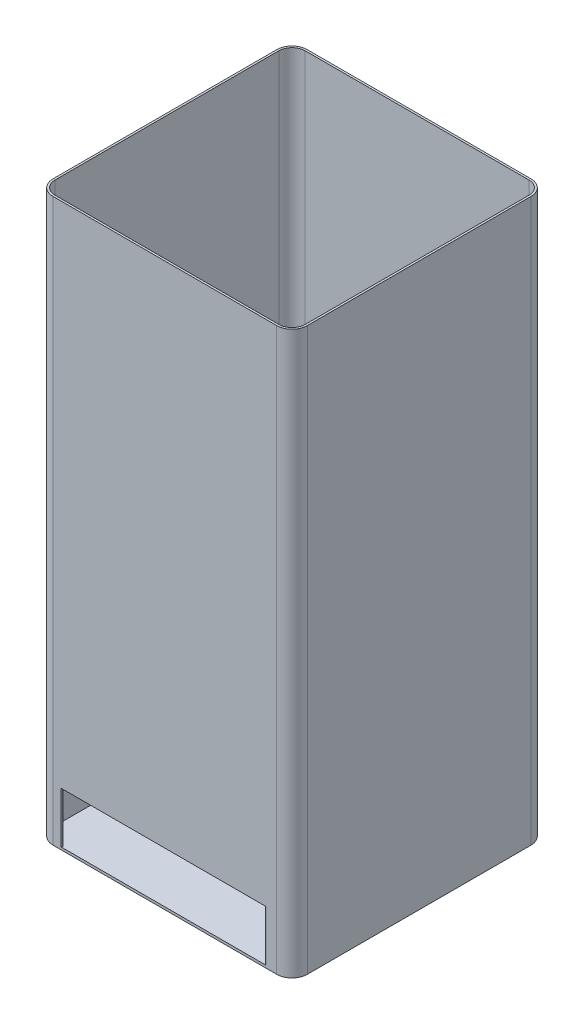
ISO-10303-21;
HEADER;
FILE_DESCRIPTION(('STEP AP214'),'2;1');
FILE_NAME('part.step','',(''),(''),'','','');
FILE_SCHEMA(('AUTOMOTIVE_DESIGN { 1 0 10303 214 1 1 1 1 }'));
ENDSEC;
DATA;
#1=APPLICATION_CONTEXT('core data for automotive mechanical design processes');
#2=APPLICATION_PROTOCOL_DEFINITION('international standard','automotive_design',2000,#1);
#3=PRODUCT_CONTEXT('',#1,'mechanical');
#4=PRODUCT('Part','Part','',(#3));
#5=PRODUCT_RELATED_PRODUCT_CATEGORY('part','',(#4));
#6=PRODUCT_DEFINITION_FORMATION('','',#4);
#7=PRODUCT_DEFINITION_CONTEXT('part definition',#1,'design');
#8=PRODUCT_DEFINITION('design','',#6,#7);
#9=PRODUCT_DEFINITION_SHAPE('','',#8);
#10=(LENGTH_UNIT() NAMED_UNIT(*) SI_UNIT(.MILLI.,.METRE.));
#11=(NAMED_UNIT(*) PLANE_ANGLE_UNIT() SI_UNIT($,.RADIAN.));
#12=(NAMED_UNIT(*) SI_UNIT($,.STERADIAN.) SOLID_ANGLE_UNIT());
#13=UNCERTAINTY_MEASURE_WITH_UNIT(LENGTH_MEASURE(1.E-05),#10,'distance_accuracy_value','');
#14=(GEOMETRIC_REPRESENTATION_CONTEXT(3) GLOBAL_UNCERTAINTY_ASSIGNED_CONTEXT((#13)) GLOBAL_UNIT_ASSIGNED_CONTEXT((#10,
#11,#12)) REPRESENTATION_CONTEXT('',''));
#15=CARTESIAN_POINT('',(0.,0.,0.));
#16=DIRECTION('',(0.,0.,1.));
#17=DIRECTION('',(1.,0.,0.));
#18=AXIS2_PLACEMENT_3D('',#15,#16,#17);
#19=CARTESIAN_POINT('',(220.,5.,220.));
#20=DIRECTION('',(0.,-1.,0.));
#21=DIRECTION('',(0.,0.,-1.));
#22=AXIS2_PLACEMENT_3D('',#19,#20,#21);
#23=PLANE('',#22);
#24=CARTESIAN_POINT('',(-204.515980857848,5.,248.5));
#25=DIRECTION('',(0.,1.,0.));
#26=DIRECTION('',(0.,0.,1.));
#27=AXIS2_PLACEMENT_3D('',#24,#25,#26);
#28=CIRCLE('',#27,1.5);
#29=CARTESIAN_POINT('',(-204.515980857848,5.,250.));
#30=VERTEX_POINT('',#29);
#31=CARTESIAN_POINT('',(-203.015980857848,5.,248.5));
#32=VERTEX_POINT('',#31);
#33=EDGE_CURVE('E364',#30,#32,#28,.T.);
#34=ORIENTED_EDGE('',*,*,#33,.F.);
#35=DIRECTION('',(1.,0.,0.));
#36=VECTOR('',#35,1.);
#37=CARTESIAN_POINT('',(220.,5.,250.));
#38=LINE('',#37,#36);
#39=CARTESIAN_POINT('',(198.484019142152,5.,250.));
#40=VERTEX_POINT('',#39);
#41=EDGE_CURVE('E438',#30,#40,#38,.T.);
#42=ORIENTED_EDGE('',*,*,#41,.T.);
#43=CARTESIAN_POINT('',(198.484019142152,5.,248.5));
#44=DIRECTION('',(0.,1.,0.));
#45=DIRECTION('',(0.,0.,-1.));
#46=AXIS2_PLACEMENT_3D('',#43,#44,#45);
#47=CIRCLE('',#46,1.5);
#48=CARTESIAN_POINT('',(196.984019142152,5.,248.5));
#49=VERTEX_POINT('',#48);
#50=EDGE_CURVE('E360',#49,#40,#47,.T.);
#51=ORIENTED_EDGE('',*,*,#50,.F.);
#52=DIRECTION('',(0.,0.,1.));
#53=VECTOR('',#52,1.);
#54=CARTESIAN_POINT('',(196.984019142152,5.,248.5));
#55=LINE('',#54,#53);
#56=CARTESIAN_POINT('',(196.984019142152,5.,247.5));
#57=VERTEX_POINT('',#56);
#58=EDGE_CURVE('E356',#57,#49,#55,.T.);
#59=ORIENTED_EDGE('',*,*,#58,.F.);
#60=CARTESIAN_POINT('',(198.484019142152,5.,247.5));
#61=DIRECTION('',(0.,1.,0.));
#62=DIRECTION('',(0.,0.,-1.));
#63=AXIS2_PLACEMENT_3D('',#60,#61,#62);
#64=CIRCLE('',#63,1.5);
#65=CARTESIAN_POINT('',(198.484019142152,5.,246.));
#66=VERTEX_POINT('',#65);
#67=EDGE_CURVE('E352',#66,#57,#64,.T.);
#68=ORIENTED_EDGE('',*,*,#67,.F.);
#69=DIRECTION('',(-1.,0.,0.));
#70=VECTOR('',#69,1.);
#71=CARTESIAN_POINT('',(198.484019142152,5.,246.));
#72=LINE('',#71,#70);
#73=CARTESIAN_POINT('',(220.,5.,246.));
#74=VERTEX_POINT('',#73);
#75=EDGE_CURVE('E348',#74,#66,#72,.T.);
#76=ORIENTED_EDGE('',*,*,#75,.F.);
#77=CARTESIAN_POINT('',(220.,5.,220.));
#78=DIRECTION('',(0.,-1.,0.));
#79=DIRECTION('',(0.,0.,-1.));
#80=AXIS2_PLACEMENT_3D('',#77,#78,#79);
#81=CIRCLE('',#80,25.9999999999999);
#82=CARTESIAN_POINT('',(246.,5.,220.));
#83=VERTEX_POINT('',#82);
#84=EDGE_CURVE('E344',#83,#74,#81,.T.);
#85=ORIENTED_EDGE('',*,*,#84,.F.);
#86=DIRECTION('',(0.,0.,1.));
#87=VECTOR('',#86,1.);
#88=CARTESIAN_POINT('',(246.,5.,-220.));
#89=LINE('',#88,#87);
#90=CARTESIAN_POINT('',(246.,5.,-220.));
#91=VERTEX_POINT('',#90);
#92=EDGE_CURVE('E340',#91,#83,#89,.T.);
#93=ORIENTED_EDGE('',*,*,#92,.F.);
#94=CARTESIAN_POINT('',(220.,5.,-220.));
#95=DIRECTION('',(0.,-1.,0.));
#96=DIRECTION('',(0.,0.,-1.));
#97=AXIS2_PLACEMENT_3D('',#94,#95,#96);
#98=CIRCLE('',#97,25.9999999999998);
#99=CARTESIAN_POINT('',(220.,5.,-246.));
#100=VERTEX_POINT('',#99);
#101=EDGE_CURVE('E336',#100,#91,#98,.T.);
#102=ORIENTED_EDGE('',*,*,#101,.F.);
#103=DIRECTION('',(1.,0.,0.));
#104=VECTOR('',#103,1.);
#105=CARTESIAN_POINT('',(-220.,5.,-246.));
#106=LINE('',#105,#104);
#107=CARTESIAN_POINT('',(-220.,5.,-246.));
#108=VERTEX_POINT('',#107);
#109=EDGE_CURVE('E332',#108,#100,#106,.T.);
#110=ORIENTED_EDGE('',*,*,#109,.F.);
#111=CARTESIAN_POINT('',(-220.,5.,-220.));
#112=DIRECTION('',(0.,-1.,0.));
#113=DIRECTION('',(0.,0.,1.));
#114=AXIS2_PLACEMENT_3D('',#111,#112,#113);
#115=CIRCLE('',#114,25.9999999999999);
#116=CARTESIAN_POINT('',(-246.,5.,-220.));
#117=VERTEX_POINT('',#116);
#118=EDGE_CURVE('E328',#117,#108,#115,.T.);
#119=ORIENTED_EDGE('',*,*,#118,.F.);
#120=DIRECTION('',(0.,0.,-1.));
#121=VECTOR('',#120,1.);
#122=CARTESIAN_POINT('',(-246.,5.,-220.));
#123=LINE('',#122,#121);
#124=CARTESIAN_POINT('',(-246.,5.,220.));
#125=VERTEX_POINT('',#124);
#126=EDGE_CURVE('E324',#125,#117,#123,.T.);
#127=ORIENTED_EDGE('',*,*,#126,.F.);
#128=CARTESIAN_POINT('',(-220.,5.,220.));
#129=DIRECTION('',(0.,-1.,0.));
#130=DIRECTION('',(0.,0.,1.));
#131=AXIS2_PLACEMENT_3D('',#128,#129,#130);
#132=CIRCLE('',#131,26.);
#133=CARTESIAN_POINT('',(-220.,5.,246.));
#134=VERTEX_POINT('',#133);
#135=EDGE_CURVE('E291',#134,#125,#132,.T.);
#136=ORIENTED_EDGE('',*,*,#135,.F.);
#137=DIRECTION('',(-1.,0.,0.));
#138=VECTOR('',#137,1.);
#139=CARTESIAN_POINT('',(-220.,5.,246.));
#140=LINE('',#139,#138);
#141=CARTESIAN_POINT('',(-204.515980857848,5.,246.));
#142=VERTEX_POINT('',#141);
#143=EDGE_CURVE('E300',#142,#134,#140,.T.);
#144=ORIENTED_EDGE('',*,*,#143,.F.);
#145=CARTESIAN_POINT('',(-204.515980857848,5.,247.5));
#146=DIRECTION('',(0.,1.,0.));
#147=DIRECTION('',(0.,0.,1.));
#148=AXIS2_PLACEMENT_3D('',#145,#146,#147);
#149=CIRCLE('',#148,1.5);
#150=CARTESIAN_POINT('',(-203.015980857848,5.,247.5));
#151=VERTEX_POINT('',#150);
#152=EDGE_CURVE('E62',#151,#142,#149,.T.);
#153=ORIENTED_EDGE('',*,*,#152,.F.);
#154=DIRECTION('',(0.,0.,-1.));
#155=VECTOR('',#154,1.);
#156=CARTESIAN_POINT('',(-203.015980857848,5.,248.5));
#157=LINE('',#156,#155);
#158=EDGE_CURVE('E57',#32,#151,#157,.T.);
#159=ORIENTED_EDGE('',*,*,#158,.F.);
#160=EDGE_LOOP('',(#34,#42,#51,#59,#68,#76,#85,#93,#102,#110,#119,#127,#136,#144,#153,#159));
#161=FACE_BOUND('',#160,.T.);
#162=ADVANCED_FACE('F41',(#161),#23,.F.);
#163=CARTESIAN_POINT('',(220.,5.,220.));
#164=DIRECTION('',(0.,-1.,0.));
#165=DIRECTION('',(0.,0.,-1.));
#166=AXIS2_PLACEMENT_3D('',#163,#164,#165);
#167=CYLINDRICAL_SURFACE('',#166,29.9999999999999);
#168=CARTESIAN_POINT('',(220.,0.,220.));
#169=DIRECTION('',(0.,1.,0.));
#170=DIRECTION('',(0.,0.,-1.));
#171=AXIS2_PLACEMENT_3D('',#168,#169,#170);
#172=CIRCLE('',#171,29.9999999999999);
#173=CARTESIAN_POINT('',(220.,0.,250.));
#174=VERTEX_POINT('',#173);
#175=CARTESIAN_POINT('',(250.,0.,220.));
#176=VERTEX_POINT('',#175);
#177=EDGE_CURVE('E437',#174,#176,#172,.T.);
#178=ORIENTED_EDGE('',*,*,#177,.T.);
#179=DIRECTION('',(0.,-1.,0.));
#180=VECTOR('',#179,1.);
#181=CARTESIAN_POINT('',(250.,5.,220.));
#182=LINE('',#181,#180);
#183=CARTESIAN_POINT('',(250.,1105.,220.));
#184=VERTEX_POINT('',#183);
#185=EDGE_CURVE('E11',#184,#176,#182,.T.);
#186=ORIENTED_EDGE('',*,*,#185,.F.);
#187=CARTESIAN_POINT('',(220.,1105.,220.));
#188=DIRECTION('',(0.,1.,0.));
#189=DIRECTION('',(0.,0.,1.));
#190=AXIS2_PLACEMENT_3D('',#187,#188,#189);
#191=CIRCLE('',#190,29.9999999999999);
#192=CARTESIAN_POINT('',(220.,1105.,250.));
#193=VERTEX_POINT('',#192);
#194=EDGE_CURVE('E224',#193,#184,#191,.T.);
#195=ORIENTED_EDGE('',*,*,#194,.F.);
#196=DIRECTION('',(0.,-1.,0.));
#197=VECTOR('',#196,1.);
#198=CARTESIAN_POINT('',(220.,5.,250.));
#199=LINE('',#198,#197);
#200=EDGE_CURVE('E213',#193,#174,#199,.T.);
#201=ORIENTED_EDGE('',*,*,#200,.T.);
#202=EDGE_LOOP('',(#178,#186,#195,#201));
#203=FACE_BOUND('',#202,.T.);
#204=ADVANCED_FACE('F43',(#203),#167,.T.);
#205=CARTESIAN_POINT('',(250.,5.,-220.));
#206=DIRECTION('',(-1.,0.,0.));
#207=DIRECTION('',(0.,0.,1.));
#208=AXIS2_PLACEMENT_3D('',#205,#206,#207);
#209=PLANE('',#208);
#210=DIRECTION('',(0.,0.,-1.));
#211=VECTOR('',#210,1.);
#212=CARTESIAN_POINT('',(250.,0.,-220.));
#213=LINE('',#212,#211);
#214=CARTESIAN_POINT('',(250.,0.,-220.));
#215=VERTEX_POINT('',#214);
#216=EDGE_CURVE('E445',#176,#215,#213,.T.);
#217=ORIENTED_EDGE('',*,*,#216,.T.);
#218=DIRECTION('',(0.,-1.,0.));
#219=VECTOR('',#218,1.);
#220=CARTESIAN_POINT('',(250.,5.,-220.));
#221=LINE('',#220,#219);
#222=CARTESIAN_POINT('',(250.,1105.,-220.));
#223=VERTEX_POINT('',#222);
#224=EDGE_CURVE('E50',#223,#215,#221,.T.);
#225=ORIENTED_EDGE('',*,*,#224,.F.);
#226=DIRECTION('',(0.,0.,-1.));
#227=VECTOR('',#226,1.);
#228=CARTESIAN_POINT('',(250.,1105.,0.));
#229=LINE('',#228,#227);
#230=EDGE_CURVE('E242',#184,#223,#229,.T.);
#231=ORIENTED_EDGE('',*,*,#230,.F.);
#232=ORIENTED_EDGE('',*,*,#185,.T.);
#233=EDGE_LOOP('',(#217,#225,#231,#232));
#234=FACE_BOUND('',#233,.T.);
#235=ADVANCED_FACE('F502',(#234),#209,.F.);
#236=CARTESIAN_POINT('',(220.,5.,-220.));
#237=DIRECTION('',(0.,-1.,0.));
#238=DIRECTION('',(0.,0.,-1.));
#239=AXIS2_PLACEMENT_3D('',#236,#237,#238);
#240=CYLINDRICAL_SURFACE('',#239,29.9999999999999);
#241=CARTESIAN_POINT('',(220.,0.,-220.));
#242=DIRECTION('',(0.,1.,0.));
#243=DIRECTION('',(0.,0.,-1.));
#244=AXIS2_PLACEMENT_3D('',#241,#242,#243);
#245=CIRCLE('',#244,29.9999999999999);
#246=CARTESIAN_POINT('',(220.,0.,-250.));
#247=VERTEX_POINT('',#246);
#248=EDGE_CURVE('E448',#215,#247,#245,.T.);
#249=ORIENTED_EDGE('',*,*,#248,.T.);
#250=DIRECTION('',(0.,-1.,0.));
#251=VECTOR('',#250,1.);
#252=CARTESIAN_POINT('',(220.,5.,-250.));
#253=LINE('',#252,#251);
#254=CARTESIAN_POINT('',(220.,1105.,-250.));
#255=VERTEX_POINT('',#254);
#256=EDGE_CURVE('E476',#255,#247,#253,.T.);
#257=ORIENTED_EDGE('',*,*,#256,.F.);
#258=CARTESIAN_POINT('',(220.,1105.,-220.));
#259=DIRECTION('',(0.,1.,0.));
#260=DIRECTION('',(0.,0.,1.));
#261=AXIS2_PLACEMENT_3D('',#258,#259,#260);
#262=CIRCLE('',#261,29.9999999999998);
#263=EDGE_CURVE('E246',#223,#255,#262,.T.);
#264=ORIENTED_EDGE('',*,*,#263,.F.);
#265=ORIENTED_EDGE('',*,*,#224,.T.);
#266=EDGE_LOOP('',(#249,#257,#264,#265));
#267=FACE_BOUND('',#266,.T.);
#268=ADVANCED_FACE('F484',(#267),#240,.T.);
#269=CARTESIAN_POINT('',(220.,5.,-250.));
#270=DIRECTION('',(0.,0.,1.));
#271=DIRECTION('',(1.,0.,0.));
#272=AXIS2_PLACEMENT_3D('',#269,#270,#271);
#273=PLANE('',#272);
#274=DIRECTION('',(-1.,0.,0.));
#275=VECTOR('',#274,1.);
#276=CARTESIAN_POINT('',(220.,0.,-250.));
#277=LINE('',#276,#275);
#278=CARTESIAN_POINT('',(-220.,0.,-250.));
#279=VERTEX_POINT('',#278);
#280=EDGE_CURVE('E451',#247,#279,#277,.T.);
#281=ORIENTED_EDGE('',*,*,#280,.T.);
#282=DIRECTION('',(0.,-1.,0.));
#283=VECTOR('',#282,1.);
#284=CARTESIAN_POINT('',(-220.,5.,-250.));
#285=LINE('',#284,#283);
#286=CARTESIAN_POINT('',(-220.,1105.,-250.));
#287=VERTEX_POINT('',#286);
#288=EDGE_CURVE('E472',#287,#279,#285,.T.);
#289=ORIENTED_EDGE('',*,*,#288,.F.);
#290=DIRECTION('',(-1.,0.,0.));
#291=VECTOR('',#290,1.);
#292=CARTESIAN_POINT('',(0.,1105.,-250.));
#293=LINE('',#292,#291);
#294=EDGE_CURVE('E250',#255,#287,#293,.T.);
#295=ORIENTED_EDGE('',*,*,#294,.F.);
#296=ORIENTED_EDGE('',*,*,#256,.T.);
#297=EDGE_LOOP('',(#281,#289,#295,#296));
#298=FACE_BOUND('',#297,.T.);
#299=ADVANCED_FACE('F494',(#298),#273,.F.);
#300=CARTESIAN_POINT('',(-220.,5.,-220.));
#301=DIRECTION('',(0.,-1.,0.));
#302=DIRECTION('',(0.,0.,-1.));
#303=AXIS2_PLACEMENT_3D('',#300,#301,#302);
#304=CYLINDRICAL_SURFACE('',#303,29.9999999999999);
#305=CARTESIAN_POINT('',(-220.,0.,-220.));
#306=DIRECTION('',(0.,1.,0.));
#307=DIRECTION('',(0.,0.,1.));
#308=AXIS2_PLACEMENT_3D('',#305,#306,#307);
#309=CIRCLE('',#308,29.9999999999999);
#310=CARTESIAN_POINT('',(-250.,0.,-220.));
#311=VERTEX_POINT('',#310);
#312=EDGE_CURVE('E454',#279,#311,#309,.T.);
#313=ORIENTED_EDGE('',*,*,#312,.T.);
#314=DIRECTION('',(0.,-1.,0.));
#315=VECTOR('',#314,1.);
#316=CARTESIAN_POINT('',(-250.,5.,-220.));
#317=LINE('',#316,#315);
#318=CARTESIAN_POINT('',(-250.,1105.,-220.));
#319=VERTEX_POINT('',#318);
#320=EDGE_CURVE('E468',#319,#311,#317,.T.);
#321=ORIENTED_EDGE('',*,*,#320,.F.);
#322=CARTESIAN_POINT('',(-220.,1105.,-220.));
#323=DIRECTION('',(0.,1.,0.));
#324=DIRECTION('',(0.,0.,1.));
#325=AXIS2_PLACEMENT_3D('',#322,#323,#324);
#326=CIRCLE('',#325,29.9999999999999);
#327=EDGE_CURVE('E254',#287,#319,#326,.T.);
#328=ORIENTED_EDGE('',*,*,#327,.F.);
#329=ORIENTED_EDGE('',*,*,#288,.T.);
#330=EDGE_LOOP('',(#313,#321,#328,#329));
#331=FACE_BOUND('',#330,.T.);
#332=ADVANCED_FACE('F498',(#331),#304,.T.);
#333=CARTESIAN_POINT('',(-250.,5.,-220.));
#334=DIRECTION('',(1.,0.,0.));
#335=DIRECTION('',(0.,0.,-1.));
#336=AXIS2_PLACEMENT_3D('',#333,#334,#335);
#337=PLANE('',#336);
#338=DIRECTION('',(0.,0.,1.));
#339=VECTOR('',#338,1.);
#340=CARTESIAN_POINT('',(-250.,0.,-220.));
#341=LINE('',#340,#339);
#342=CARTESIAN_POINT('',(-250.,0.,220.));
#343=VERTEX_POINT('',#342);
#344=EDGE_CURVE('E457',#311,#343,#341,.T.);
#345=ORIENTED_EDGE('',*,*,#344,.T.);
#346=DIRECTION('',(0.,-1.,0.));
#347=VECTOR('',#346,1.);
#348=CARTESIAN_POINT('',(-250.,5.,220.));
#349=LINE('',#348,#347);
#350=CARTESIAN_POINT('',(-250.,1105.,220.));
#351=VERTEX_POINT('',#350);
#352=EDGE_CURVE('E212',#351,#343,#349,.T.);
#353=ORIENTED_EDGE('',*,*,#352,.F.);
#354=DIRECTION('',(0.,0.,1.));
#355=VECTOR('',#354,1.);
#356=CARTESIAN_POINT('',(-250.,1105.,0.));
#357=LINE('',#356,#355);
#358=EDGE_CURVE('E231',#319,#351,#357,.T.);
#359=ORIENTED_EDGE('',*,*,#358,.F.);
#360=ORIENTED_EDGE('',*,*,#320,.T.);
#361=EDGE_LOOP('',(#345,#353,#359,#360));
#362=FACE_BOUND('',#361,.T.);
#363=ADVANCED_FACE('F500',(#362),#337,.F.);
#364=CARTESIAN_POINT('',(-220.,5.,220.));
#365=DIRECTION('',(0.,-1.,0.));
#366=DIRECTION('',(0.,0.,-1.));
#367=AXIS2_PLACEMENT_3D('',#364,#365,#366);
#368=CYLINDRICAL_SURFACE('',#367,29.9999999999999);
#369=CARTESIAN_POINT('',(-220.,0.,220.));
#370=DIRECTION('',(0.,1.,0.));
#371=DIRECTION('',(0.,0.,-1.));
#372=AXIS2_PLACEMENT_3D('',#369,#370,#371);
#373=CIRCLE('',#372,29.9999999999999);
#374=CARTESIAN_POINT('',(-220.,0.,250.));
#375=VERTEX_POINT('',#374);
#376=EDGE_CURVE('E208',#343,#375,#373,.T.);
#377=ORIENTED_EDGE('',*,*,#376,.T.);
#378=DIRECTION('',(0.,-1.,0.));
#379=VECTOR('',#378,1.);
#380=CARTESIAN_POINT('',(-220.,5.,250.));
#381=LINE('',#380,#379);
#382=CARTESIAN_POINT('',(-220.,1105.,250.));
#383=VERTEX_POINT('',#382);
#384=EDGE_CURVE('E201',#383,#375,#381,.T.);
#385=ORIENTED_EDGE('',*,*,#384,.F.);
#386=CARTESIAN_POINT('',(-220.,1105.,220.));
#387=DIRECTION('',(0.,1.,0.));
#388=DIRECTION('',(0.,0.,1.));
#389=AXIS2_PLACEMENT_3D('',#386,#387,#388);
#390=CIRCLE('',#389,29.9999999999999);
#391=EDGE_CURVE('E206',#351,#383,#390,.T.);
#392=ORIENTED_EDGE('',*,*,#391,.F.);
#393=ORIENTED_EDGE('',*,*,#352,.T.);
#394=EDGE_LOOP('',(#377,#385,#392,#393));
#395=FACE_BOUND('',#394,.T.);
#396=ADVANCED_FACE('F203',(#395),#368,.T.);
#397=CARTESIAN_POINT('',(220.,5.,250.));
#398=DIRECTION('',(0.,0.,-1.));
#399=DIRECTION('',(-1.,0.,0.));
#400=AXIS2_PLACEMENT_3D('',#397,#398,#399);
#401=PLANE('',#400);
#402=ORIENTED_EDGE('',*,*,#200,.F.);
#403=DIRECTION('',(1.,0.,0.));
#404=VECTOR('',#403,1.);
#405=CARTESIAN_POINT('',(6.44999077639192E-13,1105.,250.000000000001));
#406=LINE('',#405,#404);
#407=EDGE_CURVE('E216',#383,#193,#406,.T.);
#408=ORIENTED_EDGE('',*,*,#407,.F.);
#409=ORIENTED_EDGE('',*,*,#384,.T.);
#410=DIRECTION('',(1.,0.,0.));
#411=VECTOR('',#410,1.);
#412=CARTESIAN_POINT('',(220.,0.,250.));
#413=LINE('',#412,#411);
#414=EDGE_CURVE('E441',#375,#174,#413,.T.);
#415=ORIENTED_EDGE('',*,*,#414,.T.);
#416=EDGE_LOOP('',(#402,#408,#409,#415));
#417=FACE_BOUND('',#416,.T.);
#418=DIRECTION('',(1.,0.,0.));
#419=VECTOR('',#418,1.);
#420=CARTESIAN_POINT('',(6.44999077639192E-13,105.,250.000000000001));
#421=LINE('',#420,#419);
#422=CARTESIAN_POINT('',(-204.515980857848,105.,250.));
#423=VERTEX_POINT('',#422);
#424=CARTESIAN_POINT('',(198.484019142152,105.,250.));
#425=VERTEX_POINT('',#424);
#426=EDGE_CURVE('E237',#423,#425,#421,.T.);
#427=ORIENTED_EDGE('',*,*,#426,.T.);
#428=DIRECTION('',(0.,-1.,0.));
#429=VECTOR('',#428,1.);
#430=CARTESIAN_POINT('',(198.484019142152,105.,250.));
#431=LINE('',#430,#429);
#432=EDGE_CURVE('E393',#425,#40,#431,.T.);
#433=ORIENTED_EDGE('',*,*,#432,.T.);
#434=ORIENTED_EDGE('',*,*,#41,.F.);
#435=DIRECTION('',(0.,-1.,0.));
#436=VECTOR('',#435,1.);
#437=CARTESIAN_POINT('',(-204.515980857848,105.,250.));
#438=LINE('',#437,#436);
#439=EDGE_CURVE('E389',#423,#30,#438,.T.);
#440=ORIENTED_EDGE('',*,*,#439,.F.);
#441=EDGE_LOOP('',(#427,#433,#434,#440));
#442=FACE_BOUND('',#441,.T.);
#443=ADVANCED_FACE('F217',(#417,#442),#401,.F.);
#444=CARTESIAN_POINT('',(220.,0.,220.));
#445=DIRECTION('',(0.,-1.,0.));
#446=DIRECTION('',(0.,0.,-1.));
#447=AXIS2_PLACEMENT_3D('',#444,#445,#446);
#448=PLANE('',#447);
#449=ORIENTED_EDGE('',*,*,#177,.F.);
#450=ORIENTED_EDGE('',*,*,#414,.F.);
#451=ORIENTED_EDGE('',*,*,#376,.F.);
#452=ORIENTED_EDGE('',*,*,#344,.F.);
#453=ORIENTED_EDGE('',*,*,#312,.F.);
#454=ORIENTED_EDGE('',*,*,#280,.F.);
#455=ORIENTED_EDGE('',*,*,#248,.F.);
#456=ORIENTED_EDGE('',*,*,#216,.F.);
#457=EDGE_LOOP('',(#449,#450,#451,#452,#453,#454,#455,#456));
#458=FACE_BOUND('',#457,.T.);
#459=ADVANCED_FACE('F490',(#458),#448,.T.);
#460=CARTESIAN_POINT('',(-220.,105.,220.));
#461=DIRECTION('',(0.,-1.,0.));
#462=DIRECTION('',(0.,0.,-1.));
#463=AXIS2_PLACEMENT_3D('',#460,#461,#462);
#464=CYLINDRICAL_SURFACE('',#463,26.);
#465=ORIENTED_EDGE('',*,*,#135,.T.);
#466=DIRECTION('',(0.,-1.,0.));
#467=VECTOR('',#466,1.);
#468=CARTESIAN_POINT('',(-246.,105.,220.));
#469=LINE('',#468,#467);
#470=CARTESIAN_POINT('',(-246.,1105.,220.));
#471=VERTEX_POINT('',#470);
#472=EDGE_CURVE('E433',#471,#125,#469,.T.);
#473=ORIENTED_EDGE('',*,*,#472,.F.);
#474=CARTESIAN_POINT('',(-220.,1105.,220.));
#475=DIRECTION('',(0.,1.,0.));
#476=DIRECTION('',(0.,0.,1.));
#477=AXIS2_PLACEMENT_3D('',#474,#475,#476);
#478=CIRCLE('',#477,26.);
#479=CARTESIAN_POINT('',(-220.,1105.,246.));
#480=VERTEX_POINT('',#479);
#481=EDGE_CURVE('E263',#480,#471,#478,.F.);
#482=ORIENTED_EDGE('',*,*,#481,.F.);
#483=DIRECTION('',(0.,-1.,0.));
#484=VECTOR('',#483,1.);
#485=CARTESIAN_POINT('',(-220.,105.,246.));
#486=LINE('',#485,#484);
#487=EDGE_CURVE('E320',#480,#134,#486,.T.);
#488=ORIENTED_EDGE('',*,*,#487,.T.);
#489=EDGE_LOOP('',(#465,#473,#482,#488));
#490=FACE_BOUND('',#489,.T.);
#491=ADVANCED_FACE('F515',(#490),#464,.F.);
#492=CARTESIAN_POINT('',(-246.,105.,-220.));
#493=DIRECTION('',(-1.,0.,0.));
#494=DIRECTION('',(0.,0.,1.));
#495=AXIS2_PLACEMENT_3D('',#492,#493,#494);
#496=PLANE('',#495);
#497=ORIENTED_EDGE('',*,*,#126,.T.);
#498=DIRECTION('',(0.,-1.,0.));
#499=VECTOR('',#498,1.);
#500=CARTESIAN_POINT('',(-246.,105.,-220.));
#501=LINE('',#500,#499);
#502=CARTESIAN_POINT('',(-246.,1105.,-220.));
#503=VERTEX_POINT('',#502);
#504=EDGE_CURVE('E429',#503,#117,#501,.T.);
#505=ORIENTED_EDGE('',*,*,#504,.F.);
#506=DIRECTION('',(0.,0.,-1.));
#507=VECTOR('',#506,1.);
#508=CARTESIAN_POINT('',(-246.,1105.,0.));
#509=LINE('',#508,#507);
#510=EDGE_CURVE('E267',#471,#503,#509,.T.);
#511=ORIENTED_EDGE('',*,*,#510,.F.);
#512=ORIENTED_EDGE('',*,*,#472,.T.);
#513=EDGE_LOOP('',(#497,#505,#511,#512));
#514=FACE_BOUND('',#513,.T.);
#515=ADVANCED_FACE('F558',(#514),#496,.F.);
#516=CARTESIAN_POINT('',(-220.,105.,-220.));
#517=DIRECTION('',(0.,-1.,0.));
#518=DIRECTION('',(0.,0.,-1.));
#519=AXIS2_PLACEMENT_3D('',#516,#517,#518);
#520=CYLINDRICAL_SURFACE('',#519,25.9999999999999);
#521=ORIENTED_EDGE('',*,*,#118,.T.);
#522=DIRECTION('',(0.,-1.,0.));
#523=VECTOR('',#522,1.);
#524=CARTESIAN_POINT('',(-220.,105.,-246.));
#525=LINE('',#524,#523);
#526=CARTESIAN_POINT('',(-220.,1105.,-246.));
#527=VERTEX_POINT('',#526);
#528=EDGE_CURVE('E425',#527,#108,#525,.T.);
#529=ORIENTED_EDGE('',*,*,#528,.F.);
#530=CARTESIAN_POINT('',(-220.,1105.,-220.));
#531=DIRECTION('',(0.,1.,0.));
#532=DIRECTION('',(0.,0.,1.));
#533=AXIS2_PLACEMENT_3D('',#530,#531,#532);
#534=CIRCLE('',#533,25.9999999999999);
#535=EDGE_CURVE('E271',#503,#527,#534,.F.);
#536=ORIENTED_EDGE('',*,*,#535,.F.);
#537=ORIENTED_EDGE('',*,*,#504,.T.);
#538=EDGE_LOOP('',(#521,#529,#536,#537));
#539=FACE_BOUND('',#538,.T.);
#540=ADVANCED_FACE('F565',(#539),#520,.F.);
#541=CARTESIAN_POINT('',(-220.,105.,-246.));
#542=DIRECTION('',(0.,0.,-1.));
#543=DIRECTION('',(-1.,0.,0.));
#544=AXIS2_PLACEMENT_3D('',#541,#542,#543);
#545=PLANE('',#544);
#546=ORIENTED_EDGE('',*,*,#109,.T.);
#547=DIRECTION('',(0.,-1.,0.));
#548=VECTOR('',#547,1.);
#549=CARTESIAN_POINT('',(220.,105.,-246.));
#550=LINE('',#549,#548);
#551=CARTESIAN_POINT('',(220.,1105.,-246.));
#552=VERTEX_POINT('',#551);
#553=EDGE_CURVE('E421',#552,#100,#550,.T.);
#554=ORIENTED_EDGE('',*,*,#553,.F.);
#555=DIRECTION('',(1.,0.,0.));
#556=VECTOR('',#555,1.);
#557=CARTESIAN_POINT('',(0.,1105.,-246.));
#558=LINE('',#557,#556);
#559=EDGE_CURVE('E275',#527,#552,#558,.T.);
#560=ORIENTED_EDGE('',*,*,#559,.F.);
#561=ORIENTED_EDGE('',*,*,#528,.T.);
#562=EDGE_LOOP('',(#546,#554,#560,#561));
#563=FACE_BOUND('',#562,.T.);
#564=ADVANCED_FACE('F572',(#563),#545,.F.);
#565=CARTESIAN_POINT('',(220.,105.,-220.));
#566=DIRECTION('',(0.,-1.,0.));
#567=DIRECTION('',(0.,0.,-1.));
#568=AXIS2_PLACEMENT_3D('',#565,#566,#567);
#569=CYLINDRICAL_SURFACE('',#568,25.9999999999998);
#570=ORIENTED_EDGE('',*,*,#101,.T.);
#571=DIRECTION('',(0.,-1.,0.));
#572=VECTOR('',#571,1.);
#573=CARTESIAN_POINT('',(246.,105.,-220.));
#574=LINE('',#573,#572);
#575=CARTESIAN_POINT('',(246.,1105.,-220.));
#576=VERTEX_POINT('',#575);
#577=EDGE_CURVE('E417',#576,#91,#574,.T.);
#578=ORIENTED_EDGE('',*,*,#577,.F.);
#579=CARTESIAN_POINT('',(220.,1105.,-220.));
#580=DIRECTION('',(0.,1.,0.));
#581=DIRECTION('',(0.,0.,1.));
#582=AXIS2_PLACEMENT_3D('',#579,#580,#581);
#583=CIRCLE('',#582,25.9999999999998);
#584=EDGE_CURVE('E279',#552,#576,#583,.F.);
#585=ORIENTED_EDGE('',*,*,#584,.F.);
#586=ORIENTED_EDGE('',*,*,#553,.T.);
#587=EDGE_LOOP('',(#570,#578,#585,#586));
#588=FACE_BOUND('',#587,.T.);
#589=ADVANCED_FACE('F580',(#588),#569,.F.);
#590=CARTESIAN_POINT('',(246.,105.,-220.));
#591=DIRECTION('',(1.,0.,0.));
#592=DIRECTION('',(0.,0.,-1.));
#593=AXIS2_PLACEMENT_3D('',#590,#591,#592);
#594=PLANE('',#593);
#595=ORIENTED_EDGE('',*,*,#92,.T.);
#596=DIRECTION('',(0.,-1.,0.));
#597=VECTOR('',#596,1.);
#598=CARTESIAN_POINT('',(246.,105.,220.));
#599=LINE('',#598,#597);
#600=CARTESIAN_POINT('',(246.,1105.,220.));
#601=VERTEX_POINT('',#600);
#602=EDGE_CURVE('E413',#601,#83,#599,.T.);
#603=ORIENTED_EDGE('',*,*,#602,.F.);
#604=DIRECTION('',(0.,0.,1.));
#605=VECTOR('',#604,1.);
#606=CARTESIAN_POINT('',(246.,1105.,0.));
#607=LINE('',#606,#605);
#608=EDGE_CURVE('E283',#576,#601,#607,.T.);
#609=ORIENTED_EDGE('',*,*,#608,.F.);
#610=ORIENTED_EDGE('',*,*,#577,.T.);
#611=EDGE_LOOP('',(#595,#603,#609,#610));
#612=FACE_BOUND('',#611,.T.);
#613=ADVANCED_FACE('F588',(#612),#594,.F.);
#614=CARTESIAN_POINT('',(220.,105.,220.));
#615=DIRECTION('',(0.,-1.,0.));
#616=DIRECTION('',(0.,0.,-1.));
#617=AXIS2_PLACEMENT_3D('',#614,#615,#616);
#618=CYLINDRICAL_SURFACE('',#617,25.9999999999999);
#619=ORIENTED_EDGE('',*,*,#84,.T.);
#620=DIRECTION('',(0.,-1.,0.));
#621=VECTOR('',#620,1.);
#622=CARTESIAN_POINT('',(220.,105.,246.));
#623=LINE('',#622,#621);
#624=CARTESIAN_POINT('',(220.,1105.,246.));
#625=VERTEX_POINT('',#624);
#626=EDGE_CURVE('E409',#625,#74,#623,.T.);
#627=ORIENTED_EDGE('',*,*,#626,.F.);
#628=CARTESIAN_POINT('',(220.,1105.,220.));
#629=DIRECTION('',(0.,1.,0.));
#630=DIRECTION('',(0.,0.,1.));
#631=AXIS2_PLACEMENT_3D('',#628,#629,#630);
#632=CIRCLE('',#631,25.9999999999999);
#633=EDGE_CURVE('E287',#601,#625,#632,.F.);
#634=ORIENTED_EDGE('',*,*,#633,.F.);
#635=ORIENTED_EDGE('',*,*,#602,.T.);
#636=EDGE_LOOP('',(#619,#627,#634,#635));
#637=FACE_BOUND('',#636,.T.);
#638=ADVANCED_FACE('F596',(#637),#618,.F.);
#639=CARTESIAN_POINT('',(198.484019142152,105.,246.));
#640=DIRECTION('',(0.,0.,1.));
#641=DIRECTION('',(1.,0.,0.));
#642=AXIS2_PLACEMENT_3D('',#639,#640,#641);
#643=PLANE('',#642);
#644=ORIENTED_EDGE('',*,*,#75,.T.);
#645=DIRECTION('',(0.,-1.,0.));
#646=VECTOR('',#645,1.);
#647=CARTESIAN_POINT('',(198.484019142152,105.,246.));
#648=LINE('',#647,#646);
#649=CARTESIAN_POINT('',(198.484019142152,105.,246.));
#650=VERTEX_POINT('',#649);
#651=EDGE_CURVE('E405',#650,#66,#648,.T.);
#652=ORIENTED_EDGE('',*,*,#651,.F.);
#653=DIRECTION('',(-1.,0.,0.));
#654=VECTOR('',#653,1.);
#655=CARTESIAN_POINT('',(0.,105.,246.));
#656=LINE('',#655,#654);
#657=CARTESIAN_POINT('',(-204.515980857848,105.,246.));
#658=VERTEX_POINT('',#657);
#659=EDGE_CURVE('E233',#650,#658,#656,.T.);
#660=ORIENTED_EDGE('',*,*,#659,.T.);
#661=DIRECTION('',(0.,-1.,0.));
#662=VECTOR('',#661,1.);
#663=CARTESIAN_POINT('',(-204.515980857848,105.,246.));
#664=LINE('',#663,#662);
#665=EDGE_CURVE('E377',#658,#142,#664,.T.);
#666=ORIENTED_EDGE('',*,*,#665,.T.);
#667=ORIENTED_EDGE('',*,*,#143,.T.);
#668=ORIENTED_EDGE('',*,*,#487,.F.);
#669=DIRECTION('',(-1.,0.,0.));
#670=VECTOR('',#669,1.);
#671=CARTESIAN_POINT('',(0.,1105.,246.));
#672=LINE('',#671,#670);
#673=EDGE_CURVE('E259',#625,#480,#672,.T.);
#674=ORIENTED_EDGE('',*,*,#673,.F.);
#675=ORIENTED_EDGE('',*,*,#626,.T.);
#676=EDGE_LOOP('',(#644,#652,#660,#666,#667,#668,#674,#675));
#677=FACE_BOUND('',#676,.T.);
#678=ADVANCED_FACE('F604',(#677),#643,.F.);
#679=CARTESIAN_POINT('',(198.484019142152,105.,247.5));
#680=DIRECTION('',(0.,-1.,0.));
#681=DIRECTION('',(0.,0.,-1.));
#682=AXIS2_PLACEMENT_3D('',#679,#680,#681);
#683=CYLINDRICAL_SURFACE('',#682,1.5);
#684=ORIENTED_EDGE('',*,*,#67,.T.);
#685=DIRECTION('',(0.,-1.,0.));
#686=VECTOR('',#685,1.);
#687=CARTESIAN_POINT('',(196.984019142152,105.,247.5));
#688=LINE('',#687,#686);
#689=CARTESIAN_POINT('',(196.984019142152,105.,247.5));
#690=VERTEX_POINT('',#689);
#691=EDGE_CURVE('E401',#690,#57,#688,.T.);
#692=ORIENTED_EDGE('',*,*,#691,.F.);
#693=CARTESIAN_POINT('',(198.484019142152,105.,247.5));
#694=DIRECTION('',(0.,1.,0.));
#695=DIRECTION('',(0.,0.,-1.));
#696=AXIS2_PLACEMENT_3D('',#693,#694,#695);
#697=CIRCLE('',#696,1.5);
#698=EDGE_CURVE('E295',#650,#690,#697,.T.);
#699=ORIENTED_EDGE('',*,*,#698,.F.);
#700=ORIENTED_EDGE('',*,*,#651,.T.);
#701=EDGE_LOOP('',(#684,#692,#699,#700));
#702=FACE_BOUND('',#701,.T.);
#703=ADVANCED_FACE('F612',(#702),#683,.T.);
#704=CARTESIAN_POINT('',(196.984019142152,105.,248.5));
#705=DIRECTION('',(1.,0.,0.));
#706=DIRECTION('',(0.,0.,-1.));
#707=AXIS2_PLACEMENT_3D('',#704,#705,#706);
#708=PLANE('',#707);
#709=ORIENTED_EDGE('',*,*,#58,.T.);
#710=DIRECTION('',(0.,-1.,0.));
#711=VECTOR('',#710,1.);
#712=CARTESIAN_POINT('',(196.984019142152,105.,248.5));
#713=LINE('',#712,#711);
#714=CARTESIAN_POINT('',(196.984019142152,105.,248.5));
#715=VERTEX_POINT('',#714);
#716=EDGE_CURVE('E397',#715,#49,#713,.T.);
#717=ORIENTED_EDGE('',*,*,#716,.F.);
#718=DIRECTION('',(0.,0.,1.));
#719=VECTOR('',#718,1.);
#720=CARTESIAN_POINT('',(196.984019142152,105.,248.5));
#721=LINE('',#720,#719);
#722=EDGE_CURVE('E299',#690,#715,#721,.T.);
#723=ORIENTED_EDGE('',*,*,#722,.F.);
#724=ORIENTED_EDGE('',*,*,#691,.T.);
#725=EDGE_LOOP('',(#709,#717,#723,#724));
#726=FACE_BOUND('',#725,.T.);
#727=ADVANCED_FACE('F620',(#726),#708,.F.);
#728=CARTESIAN_POINT('',(198.484019142152,105.,248.5));
#729=DIRECTION('',(0.,-1.,0.));
#730=DIRECTION('',(0.,0.,-1.));
#731=AXIS2_PLACEMENT_3D('',#728,#729,#730);
#732=CYLINDRICAL_SURFACE('',#731,1.5);
#733=ORIENTED_EDGE('',*,*,#50,.T.);
#734=ORIENTED_EDGE('',*,*,#432,.F.);
#735=CARTESIAN_POINT('',(198.484019142152,105.,248.5));
#736=DIRECTION('',(0.,1.,0.));
#737=DIRECTION('',(0.,0.,-1.));
#738=AXIS2_PLACEMENT_3D('',#735,#736,#737);
#739=CIRCLE('',#738,1.5);
#740=EDGE_CURVE('E304',#715,#425,#739,.T.);
#741=ORIENTED_EDGE('',*,*,#740,.F.);
#742=ORIENTED_EDGE('',*,*,#716,.T.);
#743=EDGE_LOOP('',(#733,#734,#741,#742));
#744=FACE_BOUND('',#743,.T.);
#745=ADVANCED_FACE('F628',(#744),#732,.T.);
#746=CARTESIAN_POINT('',(-204.515980857848,105.,248.5));
#747=DIRECTION('',(0.,-1.,0.));
#748=DIRECTION('',(0.,0.,-1.));
#749=AXIS2_PLACEMENT_3D('',#746,#747,#748);
#750=CYLINDRICAL_SURFACE('',#749,1.5);
#751=ORIENTED_EDGE('',*,*,#33,.T.);
#752=DIRECTION('',(0.,-1.,0.));
#753=VECTOR('',#752,1.);
#754=CARTESIAN_POINT('',(-203.015980857848,105.,248.5));
#755=LINE('',#754,#753);
#756=CARTESIAN_POINT('',(-203.015980857848,105.,248.5));
#757=VERTEX_POINT('',#756);
#758=EDGE_CURVE('E385',#757,#32,#755,.T.);
#759=ORIENTED_EDGE('',*,*,#758,.F.);
#760=CARTESIAN_POINT('',(-204.515980857848,105.,248.5));
#761=DIRECTION('',(0.,1.,0.));
#762=DIRECTION('',(0.,0.,1.));
#763=AXIS2_PLACEMENT_3D('',#760,#761,#762);
#764=CIRCLE('',#763,1.5);
#765=EDGE_CURVE('E308',#423,#757,#764,.T.);
#766=ORIENTED_EDGE('',*,*,#765,.F.);
#767=ORIENTED_EDGE('',*,*,#439,.T.);
#768=EDGE_LOOP('',(#751,#759,#766,#767));
#769=FACE_BOUND('',#768,.T.);
#770=ADVANCED_FACE('F636',(#769),#750,.T.);
#771=CARTESIAN_POINT('',(-203.015980857848,105.,248.5));
#772=DIRECTION('',(-1.,0.,0.));
#773=DIRECTION('',(0.,0.,1.));
#774=AXIS2_PLACEMENT_3D('',#771,#772,#773);
#775=PLANE('',#774);
#776=ORIENTED_EDGE('',*,*,#158,.T.);
#777=DIRECTION('',(0.,-1.,0.));
#778=VECTOR('',#777,1.);
#779=CARTESIAN_POINT('',(-203.015980857848,105.,247.5));
#780=LINE('',#779,#778);
#781=CARTESIAN_POINT('',(-203.015980857848,105.,247.5));
#782=VERTEX_POINT('',#781);
#783=EDGE_CURVE('E381',#782,#151,#780,.T.);
#784=ORIENTED_EDGE('',*,*,#783,.F.);
#785=DIRECTION('',(0.,0.,-1.));
#786=VECTOR('',#785,1.);
#787=CARTESIAN_POINT('',(-203.015980857848,105.,248.5));
#788=LINE('',#787,#786);
#789=EDGE_CURVE('E312',#757,#782,#788,.T.);
#790=ORIENTED_EDGE('',*,*,#789,.F.);
#791=ORIENTED_EDGE('',*,*,#758,.T.);
#792=EDGE_LOOP('',(#776,#784,#790,#791));
#793=FACE_BOUND('',#792,.T.);
#794=ADVANCED_FACE('F644',(#793),#775,.F.);
#795=CARTESIAN_POINT('',(-204.515980857848,105.,247.5));
#796=DIRECTION('',(0.,-1.,0.));
#797=DIRECTION('',(0.,0.,-1.));
#798=AXIS2_PLACEMENT_3D('',#795,#796,#797);
#799=CYLINDRICAL_SURFACE('',#798,1.5);
#800=ORIENTED_EDGE('',*,*,#152,.T.);
#801=ORIENTED_EDGE('',*,*,#665,.F.);
#802=CARTESIAN_POINT('',(-204.515980857848,105.,247.5));
#803=DIRECTION('',(0.,1.,0.));
#804=DIRECTION('',(0.,0.,1.));
#805=AXIS2_PLACEMENT_3D('',#802,#803,#804);
#806=CIRCLE('',#805,1.5);
#807=EDGE_CURVE('E316',#782,#658,#806,.T.);
#808=ORIENTED_EDGE('',*,*,#807,.F.);
#809=ORIENTED_EDGE('',*,*,#783,.T.);
#810=EDGE_LOOP('',(#800,#801,#808,#809));
#811=FACE_BOUND('',#810,.T.);
#812=ADVANCED_FACE('F652',(#811),#799,.T.);
#813=CARTESIAN_POINT('',(0.,1105.,0.));
#814=DIRECTION('',(0.,1.,0.));
#815=DIRECTION('',(0.,0.,1.));
#816=AXIS2_PLACEMENT_3D('',#813,#814,#815);
#817=PLANE('',#816);
#818=ORIENTED_EDGE('',*,*,#391,.T.);
#819=ORIENTED_EDGE('',*,*,#407,.T.);
#820=ORIENTED_EDGE('',*,*,#194,.T.);
#821=ORIENTED_EDGE('',*,*,#230,.T.);
#822=ORIENTED_EDGE('',*,*,#263,.T.);
#823=ORIENTED_EDGE('',*,*,#294,.T.);
#824=ORIENTED_EDGE('',*,*,#327,.T.);
#825=ORIENTED_EDGE('',*,*,#358,.T.);
#826=EDGE_LOOP('',(#818,#819,#820,#821,#822,#823,#824,#825));
#827=FACE_BOUND('',#826,.T.);
#828=ORIENTED_EDGE('',*,*,#673,.T.);
#829=ORIENTED_EDGE('',*,*,#481,.T.);
#830=ORIENTED_EDGE('',*,*,#510,.T.);
#831=ORIENTED_EDGE('',*,*,#535,.T.);
#832=ORIENTED_EDGE('',*,*,#559,.T.);
#833=ORIENTED_EDGE('',*,*,#584,.T.);
#834=ORIENTED_EDGE('',*,*,#608,.T.);
#835=ORIENTED_EDGE('',*,*,#633,.T.);
#836=EDGE_LOOP('',(#828,#829,#830,#831,#832,#833,#834,#835));
#837=FACE_BOUND('',#836,.T.);
#838=ADVANCED_FACE('F227',(#827,#837),#817,.T.);
#839=CARTESIAN_POINT('',(0.,105.,0.));
#840=DIRECTION('',(0.,1.,0.));
#841=DIRECTION('',(0.,0.,1.));
#842=AXIS2_PLACEMENT_3D('',#839,#840,#841);
#843=PLANE('',#842);
#844=ORIENTED_EDGE('',*,*,#659,.F.);
#845=ORIENTED_EDGE('',*,*,#698,.T.);
#846=ORIENTED_EDGE('',*,*,#722,.T.);
#847=ORIENTED_EDGE('',*,*,#740,.T.);
#848=ORIENTED_EDGE('',*,*,#426,.F.);
#849=ORIENTED_EDGE('',*,*,#765,.T.);
#850=ORIENTED_EDGE('',*,*,#789,.T.);
#851=ORIENTED_EDGE('',*,*,#807,.T.);
#852=EDGE_LOOP('',(#844,#845,#846,#847,#848,#849,#850,#851));
#853=FACE_BOUND('',#852,.T.);
#854=ADVANCED_FACE('F667',(#853),#843,.F.);
#855=CLOSED_SHELL('',(#162,#204,#235,#268,#299,#332,#363,#396,#443,#459,#491,#515,#540,#564,
#589,#613,#638,#678,#703,#727,#745,#770,#794,#812,#838,#854));
#856=MANIFOLD_SOLID_BREP('B2',#855);
#857=ADVANCED_BREP_SHAPE_REPRESENTATION('',(#18,#856),#14);
#858=SHAPE_DEFINITION_REPRESENTATION(#9,#857);
ENDSEC;
END-ISO-10303-21;
